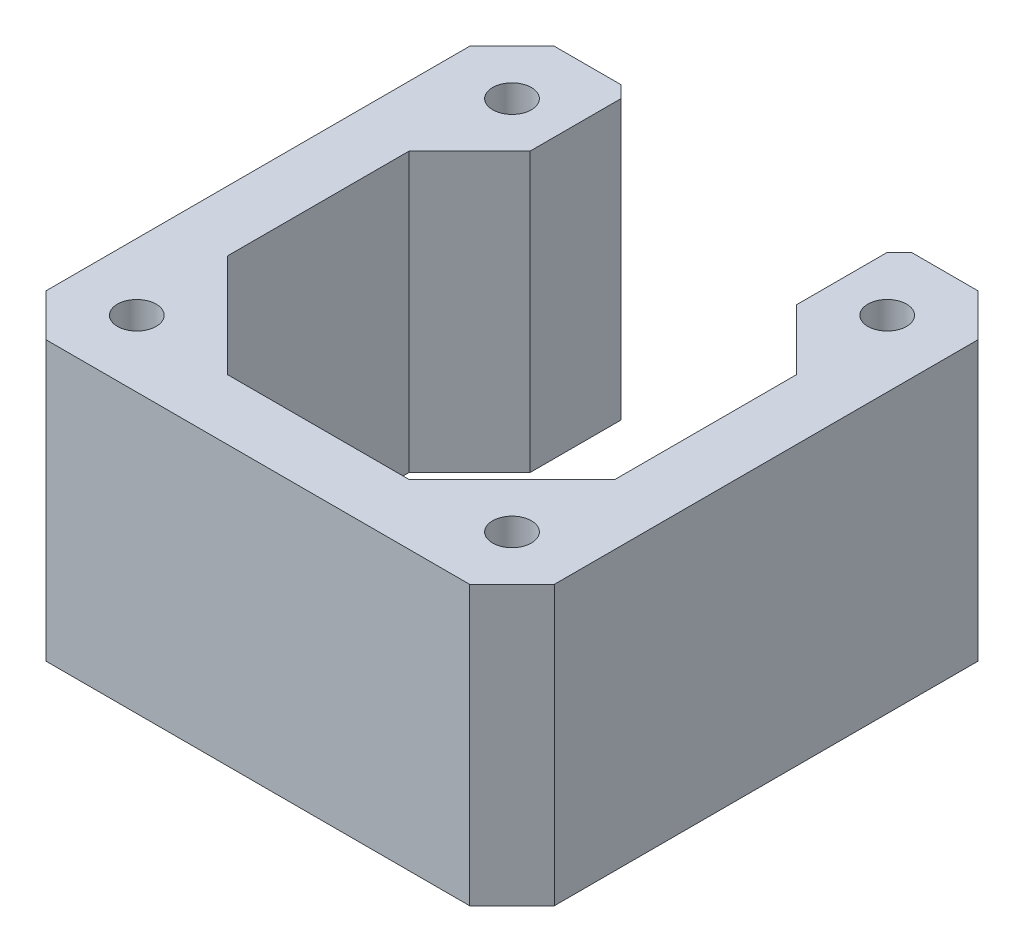
ISO-10303-21;
HEADER;
FILE_DESCRIPTION(('STEP AP214'),'2;1');
FILE_NAME('part.step','',(''),(''),'','','');
FILE_SCHEMA(('AUTOMOTIVE_DESIGN { 1 0 10303 214 1 1 1 1 }'));
ENDSEC;
DATA;
#1=APPLICATION_CONTEXT('core data for automotive mechanical design processes');
#2=APPLICATION_PROTOCOL_DEFINITION('international standard','automotive_design',2000,#1);
#3=PRODUCT_CONTEXT('',#1,'mechanical');
#4=PRODUCT('Part','Part','',(#3));
#5=PRODUCT_RELATED_PRODUCT_CATEGORY('part','',(#4));
#6=PRODUCT_DEFINITION_FORMATION('','',#4);
#7=PRODUCT_DEFINITION_CONTEXT('part definition',#1,'design');
#8=PRODUCT_DEFINITION('design','',#6,#7);
#9=PRODUCT_DEFINITION_SHAPE('','',#8);
#10=(LENGTH_UNIT() NAMED_UNIT(*) SI_UNIT(.MILLI.,.METRE.));
#11=(NAMED_UNIT(*) PLANE_ANGLE_UNIT() SI_UNIT($,.RADIAN.));
#12=(NAMED_UNIT(*) SI_UNIT($,.STERADIAN.) SOLID_ANGLE_UNIT());
#13=UNCERTAINTY_MEASURE_WITH_UNIT(LENGTH_MEASURE(1.E-05),#10,'distance_accuracy_value','');
#14=(GEOMETRIC_REPRESENTATION_CONTEXT(3) GLOBAL_UNCERTAINTY_ASSIGNED_CONTEXT((#13)) GLOBAL_UNIT_ASSIGNED_CONTEXT((#10,
#11,#12)) REPRESENTATION_CONTEXT('',''));
#15=CARTESIAN_POINT('',(0.,0.,0.));
#16=DIRECTION('',(0.,0.,1.));
#17=DIRECTION('',(1.,0.,0.));
#18=AXIS2_PLACEMENT_3D('',#15,#16,#17);
#19=CARTESIAN_POINT('',(-21.,-0.0001,17.49999999825));
#20=DIRECTION('',(-0.707106781186547,0.,0.707106781186548));
#21=DIRECTION('',(0.707106781186548,0.,0.707106781186547));
#22=AXIS2_PLACEMENT_3D('',#19,#20,#21);
#23=PLANE('',#22);
#24=DIRECTION('',(0.,1.,0.));
#25=VECTOR('',#24,1.);
#26=CARTESIAN_POINT('',(-17.5,-0.0001,20.99999999825));
#27=LINE('',#26,#25);
#28=CARTESIAN_POINT('',(-17.5,-0.0001,20.99999999825));
#29=VERTEX_POINT('',#28);
#30=CARTESIAN_POINT('',(-17.5,23.,20.99999999825));
#31=VERTEX_POINT('',#30);
#32=EDGE_CURVE('E40',#29,#31,#27,.T.);
#33=ORIENTED_EDGE('',*,*,#32,.T.);
#34=DIRECTION('',(0.707106781186548,0.,0.707106781186547));
#35=VECTOR('',#34,1.);
#36=CARTESIAN_POINT('',(-21.,23.,17.49999999825));
#37=LINE('',#36,#35);
#38=CARTESIAN_POINT('',(-21.,23.,17.49999999825));
#39=VERTEX_POINT('',#38);
#40=EDGE_CURVE('E173',#39,#31,#37,.T.);
#41=ORIENTED_EDGE('',*,*,#40,.F.);
#42=DIRECTION('',(0.,1.,0.));
#43=VECTOR('',#42,1.);
#44=CARTESIAN_POINT('',(-21.,-0.0001,17.49999999825));
#45=LINE('',#44,#43);
#46=CARTESIAN_POINT('',(-21.,-0.0001,17.49999999825));
#47=VERTEX_POINT('',#46);
#48=EDGE_CURVE('E11',#47,#39,#45,.T.);
#49=ORIENTED_EDGE('',*,*,#48,.F.);
#50=DIRECTION('',(0.707106781186548,0.,0.707106781186547));
#51=VECTOR('',#50,1.);
#52=CARTESIAN_POINT('',(-21.,-0.0001,17.49999999825));
#53=LINE('',#52,#51);
#54=EDGE_CURVE('E174',#47,#29,#53,.T.);
#55=ORIENTED_EDGE('',*,*,#54,.T.);
#56=EDGE_LOOP('',(#33,#41,#49,#55));
#57=FACE_BOUND('',#56,.T.);
#58=ADVANCED_FACE('F37',(#57),#23,.T.);
#59=CARTESIAN_POINT('',(-21.,-0.0001,-17.50000000875));
#60=DIRECTION('',(-1.,0.,0.));
#61=DIRECTION('',(0.,0.,1.));
#62=AXIS2_PLACEMENT_3D('',#59,#60,#61);
#63=PLANE('',#62);
#64=ORIENTED_EDGE('',*,*,#48,.T.);
#65=DIRECTION('',(0.,0.,1.));
#66=VECTOR('',#65,1.);
#67=CARTESIAN_POINT('',(-21.,23.,-17.50000000875));
#68=LINE('',#67,#66);
#69=CARTESIAN_POINT('',(-21.,23.,-17.50000000875));
#70=VERTEX_POINT('',#69);
#71=EDGE_CURVE('E192',#70,#39,#68,.T.);
#72=ORIENTED_EDGE('',*,*,#71,.F.);
#73=DIRECTION('',(0.,1.,0.));
#74=VECTOR('',#73,1.);
#75=CARTESIAN_POINT('',(-21.,-0.0001,-17.50000000875));
#76=LINE('',#75,#74);
#77=CARTESIAN_POINT('',(-21.,-0.0001,-17.50000000875));
#78=VERTEX_POINT('',#77);
#79=EDGE_CURVE('E45',#78,#70,#76,.T.);
#80=ORIENTED_EDGE('',*,*,#79,.F.);
#81=DIRECTION('',(0.,0.,1.));
#82=VECTOR('',#81,1.);
#83=CARTESIAN_POINT('',(-21.,-0.0001,-17.50000000875));
#84=LINE('',#83,#82);
#85=EDGE_CURVE('E179',#78,#47,#84,.T.);
#86=ORIENTED_EDGE('',*,*,#85,.T.);
#87=EDGE_LOOP('',(#64,#72,#80,#86));
#88=FACE_BOUND('',#87,.T.);
#89=ADVANCED_FACE('F417',(#88),#63,.T.);
#90=CARTESIAN_POINT('',(-17.5000000035,-0.0001,-21.00000000525));
#91=DIRECTION('',(-0.707106781186548,0.,-0.707106781186547));
#92=DIRECTION('',(-0.707106781186547,0.,0.707106781186548));
#93=AXIS2_PLACEMENT_3D('',#90,#91,#92);
#94=PLANE('',#93);
#95=ORIENTED_EDGE('',*,*,#79,.T.);
#96=DIRECTION('',(-0.707106781186547,0.,0.707106781186548));
#97=VECTOR('',#96,1.);
#98=CARTESIAN_POINT('',(-17.5000000035,23.,-21.00000000525));
#99=LINE('',#98,#97);
#100=CARTESIAN_POINT('',(-17.5000000035,23.,-21.00000000525));
#101=VERTEX_POINT('',#100);
#102=EDGE_CURVE('E246',#101,#70,#99,.T.);
#103=ORIENTED_EDGE('',*,*,#102,.F.);
#104=DIRECTION('',(0.,1.,0.));
#105=VECTOR('',#104,1.);
#106=CARTESIAN_POINT('',(-17.5000000035,-0.0001,-21.00000000525));
#107=LINE('',#106,#105);
#108=CARTESIAN_POINT('',(-17.5000000035,-0.0001,-21.00000000525));
#109=VERTEX_POINT('',#108);
#110=EDGE_CURVE('E316',#109,#101,#107,.T.);
#111=ORIENTED_EDGE('',*,*,#110,.F.);
#112=DIRECTION('',(-0.707106781186547,0.,0.707106781186548));
#113=VECTOR('',#112,1.);
#114=CARTESIAN_POINT('',(-17.5000000035,-0.0001,-21.00000000525));
#115=LINE('',#114,#113);
#116=EDGE_CURVE('E312',#109,#78,#115,.T.);
#117=ORIENTED_EDGE('',*,*,#116,.T.);
#118=EDGE_LOOP('',(#95,#103,#111,#117));
#119=FACE_BOUND('',#118,.T.);
#120=ADVANCED_FACE('F416',(#119),#94,.T.);
#121=CARTESIAN_POINT('',(-17.5000000035,-0.0001,-21.00000000525));
#122=DIRECTION('',(0.,0.,-1.));
#123=DIRECTION('',(-1.,0.,0.));
#124=AXIS2_PLACEMENT_3D('',#121,#122,#123);
#125=PLANE('',#124);
#126=ORIENTED_EDGE('',*,*,#110,.T.);
#127=DIRECTION('',(-1.,0.,0.));
#128=VECTOR('',#127,1.);
#129=CARTESIAN_POINT('',(-17.5000000035,23.,-21.00000000525));
#130=LINE('',#129,#128);
#131=CARTESIAN_POINT('',(-11.9999999995882,23.,-21.00000000525));
#132=VERTEX_POINT('',#131);
#133=EDGE_CURVE('E243',#132,#101,#130,.T.);
#134=ORIENTED_EDGE('',*,*,#133,.F.);
#135=DIRECTION('',(0.,1.,0.));
#136=VECTOR('',#135,1.);
#137=CARTESIAN_POINT('',(-11.9999999995882,-0.0001,-21.00000000525));
#138=LINE('',#137,#136);
#139=CARTESIAN_POINT('',(-11.9999999995882,-0.0001,-21.00000000525));
#140=VERTEX_POINT('',#139);
#141=EDGE_CURVE('E318',#140,#132,#138,.T.);
#142=ORIENTED_EDGE('',*,*,#141,.F.);
#143=DIRECTION('',(-1.,0.,0.));
#144=VECTOR('',#143,1.);
#145=CARTESIAN_POINT('',(-17.5000000035,-0.0001,-21.00000000525));
#146=LINE('',#145,#144);
#147=EDGE_CURVE('E309',#140,#109,#146,.T.);
#148=ORIENTED_EDGE('',*,*,#147,.T.);
#149=EDGE_LOOP('',(#126,#134,#142,#148));
#150=FACE_BOUND('',#149,.T.);
#151=ADVANCED_FACE('F412',(#150),#125,.T.);
#152=CARTESIAN_POINT('',(-11.9999999995882,-0.0001,-21.00000000525));
#153=DIRECTION('',(0.707106781186547,0.,-0.707106781186548));
#154=DIRECTION('',(-0.707106781186548,0.,-0.707106781186547));
#155=AXIS2_PLACEMENT_3D('',#152,#153,#154);
#156=PLANE('',#155);
#157=ORIENTED_EDGE('',*,*,#141,.T.);
#158=DIRECTION('',(-0.707106781186548,0.,-0.707106781186547));
#159=VECTOR('',#158,1.);
#160=CARTESIAN_POINT('',(-11.9999999995882,23.,-21.00000000525));
#161=LINE('',#160,#159);
#162=CARTESIAN_POINT('',(-10.9999999995882,23.,-20.00000000525));
#163=VERTEX_POINT('',#162);
#164=EDGE_CURVE('E240',#163,#132,#161,.T.);
#165=ORIENTED_EDGE('',*,*,#164,.F.);
#166=DIRECTION('',(0.,1.,0.));
#167=VECTOR('',#166,1.);
#168=CARTESIAN_POINT('',(-10.9999999995882,-0.0001,-20.00000000525));
#169=LINE('',#168,#167);
#170=CARTESIAN_POINT('',(-10.9999999995882,-0.0001,-20.00000000525));
#171=VERTEX_POINT('',#170);
#172=EDGE_CURVE('E320',#171,#163,#169,.T.);
#173=ORIENTED_EDGE('',*,*,#172,.F.);
#174=DIRECTION('',(-0.707106781186548,0.,-0.707106781186547));
#175=VECTOR('',#174,1.);
#176=CARTESIAN_POINT('',(-11.9999999995882,-0.0001,-21.00000000525));
#177=LINE('',#176,#175);
#178=EDGE_CURVE('E306',#171,#140,#177,.T.);
#179=ORIENTED_EDGE('',*,*,#178,.T.);
#180=EDGE_LOOP('',(#157,#165,#173,#179));
#181=FACE_BOUND('',#180,.T.);
#182=ADVANCED_FACE('F407',(#181),#156,.T.);
#183=CARTESIAN_POINT('',(-10.9999999995882,-0.0001,-20.00000000525));
#184=DIRECTION('',(1.,0.,0.));
#185=DIRECTION('',(0.,0.,-1.));
#186=AXIS2_PLACEMENT_3D('',#183,#184,#185);
#187=PLANE('',#186);
#188=ORIENTED_EDGE('',*,*,#172,.T.);
#189=DIRECTION('',(0.,0.,-1.));
#190=VECTOR('',#189,1.);
#191=CARTESIAN_POINT('',(-10.9999999995882,23.,-20.00000000525));
#192=LINE('',#191,#190);
#193=CARTESIAN_POINT('',(-10.9999999995882,23.,-12.5000000021618));
#194=VERTEX_POINT('',#193);
#195=EDGE_CURVE('E237',#194,#163,#192,.T.);
#196=ORIENTED_EDGE('',*,*,#195,.F.);
#197=DIRECTION('',(0.,1.,0.));
#198=VECTOR('',#197,1.);
#199=CARTESIAN_POINT('',(-10.9999999995882,-0.0001,-12.5000000021618));
#200=LINE('',#199,#198);
#201=CARTESIAN_POINT('',(-10.9999999995882,-0.0001,-12.5000000021618));
#202=VERTEX_POINT('',#201);
#203=EDGE_CURVE('E322',#202,#194,#200,.T.);
#204=ORIENTED_EDGE('',*,*,#203,.F.);
#205=DIRECTION('',(0.,0.,-1.));
#206=VECTOR('',#205,1.);
#207=CARTESIAN_POINT('',(-10.9999999995882,-0.0001,-20.00000000525));
#208=LINE('',#207,#206);
#209=EDGE_CURVE('E303',#202,#171,#208,.T.);
#210=ORIENTED_EDGE('',*,*,#209,.T.);
#211=EDGE_LOOP('',(#188,#196,#204,#210));
#212=FACE_BOUND('',#211,.T.);
#213=ADVANCED_FACE('F405',(#212),#187,.T.);
#214=CARTESIAN_POINT('',(-10.9999999995882,-0.0001,-12.5000000021618));
#215=DIRECTION('',(0.707106781186547,0.,0.707106781186548));
#216=DIRECTION('',(0.707106781186548,0.,-0.707106781186547));
#217=AXIS2_PLACEMENT_3D('',#214,#215,#216);
#218=PLANE('',#217);
#219=ORIENTED_EDGE('',*,*,#203,.T.);
#220=DIRECTION('',(0.707106781186548,0.,-0.707106781186547));
#221=VECTOR('',#220,1.);
#222=CARTESIAN_POINT('',(-10.9999999995882,23.,-12.5000000021618));
#223=LINE('',#222,#221);
#224=CARTESIAN_POINT('',(-16.,23.,-7.50000000175));
#225=VERTEX_POINT('',#224);
#226=EDGE_CURVE('E234',#225,#194,#223,.T.);
#227=ORIENTED_EDGE('',*,*,#226,.F.);
#228=DIRECTION('',(0.,1.,0.));
#229=VECTOR('',#228,1.);
#230=CARTESIAN_POINT('',(-16.,-0.0001,-7.50000000175));
#231=LINE('',#230,#229);
#232=CARTESIAN_POINT('',(-16.,-0.0001,-7.50000000175));
#233=VERTEX_POINT('',#232);
#234=EDGE_CURVE('E324',#233,#225,#231,.T.);
#235=ORIENTED_EDGE('',*,*,#234,.F.);
#236=DIRECTION('',(0.707106781186548,0.,-0.707106781186547));
#237=VECTOR('',#236,1.);
#238=CARTESIAN_POINT('',(-10.9999999995882,-0.0001,-12.5000000021618));
#239=LINE('',#238,#237);
#240=EDGE_CURVE('E300',#233,#202,#239,.T.);
#241=ORIENTED_EDGE('',*,*,#240,.T.);
#242=EDGE_LOOP('',(#219,#227,#235,#241));
#243=FACE_BOUND('',#242,.T.);
#244=ADVANCED_FACE('F400',(#243),#218,.T.);
#245=CARTESIAN_POINT('',(-16.,-0.0001,-7.50000000175));
#246=DIRECTION('',(1.,0.,0.));
#247=DIRECTION('',(0.,0.,-1.));
#248=AXIS2_PLACEMENT_3D('',#245,#246,#247);
#249=PLANE('',#248);
#250=ORIENTED_EDGE('',*,*,#234,.T.);
#251=DIRECTION('',(0.,0.,-1.));
#252=VECTOR('',#251,1.);
#253=CARTESIAN_POINT('',(-16.,23.,-7.50000000175));
#254=LINE('',#253,#252);
#255=CARTESIAN_POINT('',(-16.,23.,7.49999999825));
#256=VERTEX_POINT('',#255);
#257=EDGE_CURVE('E231',#256,#225,#254,.T.);
#258=ORIENTED_EDGE('',*,*,#257,.F.);
#259=DIRECTION('',(0.,1.,0.));
#260=VECTOR('',#259,1.);
#261=CARTESIAN_POINT('',(-16.,-0.0001,7.49999999825));
#262=LINE('',#261,#260);
#263=CARTESIAN_POINT('',(-16.,-0.0001,7.49999999825));
#264=VERTEX_POINT('',#263);
#265=EDGE_CURVE('E326',#264,#256,#262,.T.);
#266=ORIENTED_EDGE('',*,*,#265,.F.);
#267=DIRECTION('',(0.,0.,-1.));
#268=VECTOR('',#267,1.);
#269=CARTESIAN_POINT('',(-16.,-0.0001,-7.50000000175));
#270=LINE('',#269,#268);
#271=EDGE_CURVE('E297',#264,#233,#270,.T.);
#272=ORIENTED_EDGE('',*,*,#271,.T.);
#273=EDGE_LOOP('',(#250,#258,#266,#272));
#274=FACE_BOUND('',#273,.T.);
#275=ADVANCED_FACE('F395',(#274),#249,.T.);
#276=CARTESIAN_POINT('',(-16.,-0.0001,7.49999999825));
#277=DIRECTION('',(0.707106781186547,0.,-0.707106781186548));
#278=DIRECTION('',(-0.707106781186548,0.,-0.707106781186547));
#279=AXIS2_PLACEMENT_3D('',#276,#277,#278);
#280=PLANE('',#279);
#281=ORIENTED_EDGE('',*,*,#265,.T.);
#282=DIRECTION('',(-0.707106781186548,0.,-0.707106781186547));
#283=VECTOR('',#282,1.);
#284=CARTESIAN_POINT('',(-16.,23.,7.49999999825));
#285=LINE('',#284,#283);
#286=CARTESIAN_POINT('',(-7.5,23.,15.99999999825));
#287=VERTEX_POINT('',#286);
#288=EDGE_CURVE('E228',#287,#256,#285,.T.);
#289=ORIENTED_EDGE('',*,*,#288,.F.);
#290=DIRECTION('',(0.,1.,0.));
#291=VECTOR('',#290,1.);
#292=CARTESIAN_POINT('',(-7.5,-0.0001,15.99999999825));
#293=LINE('',#292,#291);
#294=CARTESIAN_POINT('',(-7.5,-0.0001,15.99999999825));
#295=VERTEX_POINT('',#294);
#296=EDGE_CURVE('E328',#295,#287,#293,.T.);
#297=ORIENTED_EDGE('',*,*,#296,.F.);
#298=DIRECTION('',(-0.707106781186548,0.,-0.707106781186547));
#299=VECTOR('',#298,1.);
#300=CARTESIAN_POINT('',(-16.,-0.0001,7.49999999825));
#301=LINE('',#300,#299);
#302=EDGE_CURVE('E294',#295,#264,#301,.T.);
#303=ORIENTED_EDGE('',*,*,#302,.T.);
#304=EDGE_LOOP('',(#281,#289,#297,#303));
#305=FACE_BOUND('',#304,.T.);
#306=ADVANCED_FACE('F393',(#305),#280,.T.);
#307=CARTESIAN_POINT('',(-7.5,-0.0001,15.99999999825));
#308=DIRECTION('',(0.,0.,-1.));
#309=DIRECTION('',(-1.,0.,0.));
#310=AXIS2_PLACEMENT_3D('',#307,#308,#309);
#311=PLANE('',#310);
#312=ORIENTED_EDGE('',*,*,#296,.T.);
#313=DIRECTION('',(-1.,0.,0.));
#314=VECTOR('',#313,1.);
#315=CARTESIAN_POINT('',(-7.5,23.,15.99999999825));
#316=LINE('',#315,#314);
#317=CARTESIAN_POINT('',(7.5,23.,15.99999999825));
#318=VERTEX_POINT('',#317);
#319=EDGE_CURVE('E225',#318,#287,#316,.T.);
#320=ORIENTED_EDGE('',*,*,#319,.F.);
#321=DIRECTION('',(0.,1.,0.));
#322=VECTOR('',#321,1.);
#323=CARTESIAN_POINT('',(7.5,-0.0001,15.99999999825));
#324=LINE('',#323,#322);
#325=CARTESIAN_POINT('',(7.5,-0.0001,15.99999999825));
#326=VERTEX_POINT('',#325);
#327=EDGE_CURVE('E330',#326,#318,#324,.T.);
#328=ORIENTED_EDGE('',*,*,#327,.F.);
#329=DIRECTION('',(-1.,0.,0.));
#330=VECTOR('',#329,1.);
#331=CARTESIAN_POINT('',(-7.5,-0.0001,15.99999999825));
#332=LINE('',#331,#330);
#333=EDGE_CURVE('E291',#326,#295,#332,.T.);
#334=ORIENTED_EDGE('',*,*,#333,.T.);
#335=EDGE_LOOP('',(#312,#320,#328,#334));
#336=FACE_BOUND('',#335,.T.);
#337=ADVANCED_FACE('F388',(#336),#311,.T.);
#338=CARTESIAN_POINT('',(16.,-0.0001,7.49999999825));
#339=DIRECTION('',(-0.707106781186547,0.,-0.707106781186548));
#340=DIRECTION('',(-0.707106781186548,0.,0.707106781186547));
#341=AXIS2_PLACEMENT_3D('',#338,#339,#340);
#342=PLANE('',#341);
#343=ORIENTED_EDGE('',*,*,#327,.T.);
#344=DIRECTION('',(-0.707106781186548,0.,0.707106781186547));
#345=VECTOR('',#344,1.);
#346=CARTESIAN_POINT('',(16.,23.,7.49999999825));
#347=LINE('',#346,#345);
#348=CARTESIAN_POINT('',(16.,23.,7.49999999825));
#349=VERTEX_POINT('',#348);
#350=EDGE_CURVE('E222',#349,#318,#347,.T.);
#351=ORIENTED_EDGE('',*,*,#350,.F.);
#352=DIRECTION('',(0.,1.,0.));
#353=VECTOR('',#352,1.);
#354=CARTESIAN_POINT('',(16.,-0.0001,7.49999999825));
#355=LINE('',#354,#353);
#356=CARTESIAN_POINT('',(16.,-0.0001,7.49999999825));
#357=VERTEX_POINT('',#356);
#358=EDGE_CURVE('E332',#357,#349,#355,.T.);
#359=ORIENTED_EDGE('',*,*,#358,.F.);
#360=DIRECTION('',(-0.707106781186548,0.,0.707106781186547));
#361=VECTOR('',#360,1.);
#362=CARTESIAN_POINT('',(16.,-0.0001,7.49999999825));
#363=LINE('',#362,#361);
#364=EDGE_CURVE('E288',#357,#326,#363,.T.);
#365=ORIENTED_EDGE('',*,*,#364,.T.);
#366=EDGE_LOOP('',(#343,#351,#359,#365));
#367=FACE_BOUND('',#366,.T.);
#368=ADVANCED_FACE('F383',(#367),#342,.T.);
#369=CARTESIAN_POINT('',(16.,-0.0001,-7.50000000175));
#370=DIRECTION('',(-1.,0.,0.));
#371=DIRECTION('',(0.,0.,1.));
#372=AXIS2_PLACEMENT_3D('',#369,#370,#371);
#373=PLANE('',#372);
#374=ORIENTED_EDGE('',*,*,#358,.T.);
#375=DIRECTION('',(0.,0.,1.));
#376=VECTOR('',#375,1.);
#377=CARTESIAN_POINT('',(16.,23.,-7.50000000175));
#378=LINE('',#377,#376);
#379=CARTESIAN_POINT('',(16.,23.,-7.50000000175));
#380=VERTEX_POINT('',#379);
#381=EDGE_CURVE('E219',#380,#349,#378,.T.);
#382=ORIENTED_EDGE('',*,*,#381,.F.);
#383=DIRECTION('',(0.,1.,0.));
#384=VECTOR('',#383,1.);
#385=CARTESIAN_POINT('',(16.,-0.0001,-7.50000000175));
#386=LINE('',#385,#384);
#387=CARTESIAN_POINT('',(16.,-0.0001,-7.50000000175));
#388=VERTEX_POINT('',#387);
#389=EDGE_CURVE('E334',#388,#380,#386,.T.);
#390=ORIENTED_EDGE('',*,*,#389,.F.);
#391=DIRECTION('',(0.,0.,1.));
#392=VECTOR('',#391,1.);
#393=CARTESIAN_POINT('',(16.,-0.0001,-7.50000000175));
#394=LINE('',#393,#392);
#395=EDGE_CURVE('E285',#388,#357,#394,.T.);
#396=ORIENTED_EDGE('',*,*,#395,.T.);
#397=EDGE_LOOP('',(#374,#382,#390,#396));
#398=FACE_BOUND('',#397,.T.);
#399=ADVANCED_FACE('F381',(#398),#373,.T.);
#400=CARTESIAN_POINT('',(10.9999999995882,-0.0001,-12.5000000021618));
#401=DIRECTION('',(-0.707106781186547,0.,0.707106781186548));
#402=DIRECTION('',(0.707106781186548,0.,0.707106781186547));
#403=AXIS2_PLACEMENT_3D('',#400,#401,#402);
#404=PLANE('',#403);
#405=ORIENTED_EDGE('',*,*,#389,.T.);
#406=DIRECTION('',(0.707106781186548,0.,0.707106781186547));
#407=VECTOR('',#406,1.);
#408=CARTESIAN_POINT('',(10.9999999995882,23.,-12.5000000021618));
#409=LINE('',#408,#407);
#410=CARTESIAN_POINT('',(10.9999999995882,23.,-12.5000000021618));
#411=VERTEX_POINT('',#410);
#412=EDGE_CURVE('E216',#411,#380,#409,.T.);
#413=ORIENTED_EDGE('',*,*,#412,.F.);
#414=DIRECTION('',(0.,1.,0.));
#415=VECTOR('',#414,1.);
#416=CARTESIAN_POINT('',(10.9999999995882,-0.0001,-12.5000000021618));
#417=LINE('',#416,#415);
#418=CARTESIAN_POINT('',(10.9999999995882,-0.0001,-12.5000000021618));
#419=VERTEX_POINT('',#418);
#420=EDGE_CURVE('E336',#419,#411,#417,.T.);
#421=ORIENTED_EDGE('',*,*,#420,.F.);
#422=DIRECTION('',(0.707106781186548,0.,0.707106781186547));
#423=VECTOR('',#422,1.);
#424=CARTESIAN_POINT('',(10.9999999995882,-0.0001,-12.5000000021618));
#425=LINE('',#424,#423);
#426=EDGE_CURVE('E282',#419,#388,#425,.T.);
#427=ORIENTED_EDGE('',*,*,#426,.T.);
#428=EDGE_LOOP('',(#405,#413,#421,#427));
#429=FACE_BOUND('',#428,.T.);
#430=ADVANCED_FACE('F376',(#429),#404,.T.);
#431=CARTESIAN_POINT('',(10.9999999995882,-0.0001,-20.00000000525));
#432=DIRECTION('',(-1.,0.,0.));
#433=DIRECTION('',(0.,0.,1.));
#434=AXIS2_PLACEMENT_3D('',#431,#432,#433);
#435=PLANE('',#434);
#436=ORIENTED_EDGE('',*,*,#420,.T.);
#437=DIRECTION('',(0.,0.,1.));
#438=VECTOR('',#437,1.);
#439=CARTESIAN_POINT('',(10.9999999995882,23.,-20.00000000525));
#440=LINE('',#439,#438);
#441=CARTESIAN_POINT('',(10.9999999995882,23.,-20.00000000525));
#442=VERTEX_POINT('',#441);
#443=EDGE_CURVE('E213',#442,#411,#440,.T.);
#444=ORIENTED_EDGE('',*,*,#443,.F.);
#445=DIRECTION('',(0.,1.,0.));
#446=VECTOR('',#445,1.);
#447=CARTESIAN_POINT('',(10.9999999995882,-0.0001,-20.00000000525));
#448=LINE('',#447,#446);
#449=CARTESIAN_POINT('',(10.9999999995882,-0.0001,-20.00000000525));
#450=VERTEX_POINT('',#449);
#451=EDGE_CURVE('E338',#450,#442,#448,.T.);
#452=ORIENTED_EDGE('',*,*,#451,.F.);
#453=DIRECTION('',(0.,0.,1.));
#454=VECTOR('',#453,1.);
#455=CARTESIAN_POINT('',(10.9999999995882,-0.0001,-20.00000000525));
#456=LINE('',#455,#454);
#457=EDGE_CURVE('E279',#450,#419,#456,.T.);
#458=ORIENTED_EDGE('',*,*,#457,.T.);
#459=EDGE_LOOP('',(#436,#444,#452,#458));
#460=FACE_BOUND('',#459,.T.);
#461=ADVANCED_FACE('F371',(#460),#435,.T.);
#462=CARTESIAN_POINT('',(11.9999999995882,-0.0001,-21.00000000525));
#463=DIRECTION('',(-0.707106781186549,0.,-0.707106781186546));
#464=DIRECTION('',(-0.707106781186546,0.,0.707106781186549));
#465=AXIS2_PLACEMENT_3D('',#462,#463,#464);
#466=PLANE('',#465);
#467=ORIENTED_EDGE('',*,*,#451,.T.);
#468=DIRECTION('',(-0.707106781186546,0.,0.707106781186549));
#469=VECTOR('',#468,1.);
#470=CARTESIAN_POINT('',(11.9999999995882,23.,-21.00000000525));
#471=LINE('',#470,#469);
#472=CARTESIAN_POINT('',(11.9999999995882,23.,-21.00000000525));
#473=VERTEX_POINT('',#472);
#474=EDGE_CURVE('E210',#473,#442,#471,.T.);
#475=ORIENTED_EDGE('',*,*,#474,.F.);
#476=DIRECTION('',(0.,1.,0.));
#477=VECTOR('',#476,1.);
#478=CARTESIAN_POINT('',(11.9999999995882,-0.0001,-21.00000000525));
#479=LINE('',#478,#477);
#480=CARTESIAN_POINT('',(11.9999999995882,-0.0001,-21.00000000525));
#481=VERTEX_POINT('',#480);
#482=EDGE_CURVE('E340',#481,#473,#479,.T.);
#483=ORIENTED_EDGE('',*,*,#482,.F.);
#484=DIRECTION('',(-0.707106781186546,0.,0.707106781186549));
#485=VECTOR('',#484,1.);
#486=CARTESIAN_POINT('',(11.9999999995882,-0.0001,-21.00000000525));
#487=LINE('',#486,#485);
#488=EDGE_CURVE('E276',#481,#450,#487,.T.);
#489=ORIENTED_EDGE('',*,*,#488,.T.);
#490=EDGE_LOOP('',(#467,#475,#483,#489));
#491=FACE_BOUND('',#490,.T.);
#492=ADVANCED_FACE('F369',(#491),#466,.T.);
#493=CARTESIAN_POINT('',(17.5000000035,-0.0001,-21.00000000525));
#494=DIRECTION('',(0.,0.,-1.));
#495=DIRECTION('',(-1.,0.,0.));
#496=AXIS2_PLACEMENT_3D('',#493,#494,#495);
#497=PLANE('',#496);
#498=ORIENTED_EDGE('',*,*,#482,.T.);
#499=DIRECTION('',(-1.,0.,0.));
#500=VECTOR('',#499,1.);
#501=CARTESIAN_POINT('',(17.5000000035,23.,-21.00000000525));
#502=LINE('',#501,#500);
#503=CARTESIAN_POINT('',(17.5000000035,23.,-21.00000000525));
#504=VERTEX_POINT('',#503);
#505=EDGE_CURVE('E207',#504,#473,#502,.T.);
#506=ORIENTED_EDGE('',*,*,#505,.F.);
#507=DIRECTION('',(0.,1.,0.));
#508=VECTOR('',#507,1.);
#509=CARTESIAN_POINT('',(17.5000000035,-0.0001,-21.00000000525));
#510=LINE('',#509,#508);
#511=CARTESIAN_POINT('',(17.5000000035,-0.0001,-21.00000000525));
#512=VERTEX_POINT('',#511);
#513=EDGE_CURVE('E342',#512,#504,#510,.T.);
#514=ORIENTED_EDGE('',*,*,#513,.F.);
#515=DIRECTION('',(-1.,0.,0.));
#516=VECTOR('',#515,1.);
#517=CARTESIAN_POINT('',(17.5000000035,-0.0001,-21.00000000525));
#518=LINE('',#517,#516);
#519=EDGE_CURVE('E273',#512,#481,#518,.T.);
#520=ORIENTED_EDGE('',*,*,#519,.T.);
#521=EDGE_LOOP('',(#498,#506,#514,#520));
#522=FACE_BOUND('',#521,.T.);
#523=ADVANCED_FACE('F364',(#522),#497,.T.);
#524=CARTESIAN_POINT('',(17.5000000035,-0.0001,-21.00000000525));
#525=DIRECTION('',(0.707106781186548,0.,-0.707106781186547));
#526=DIRECTION('',(-0.707106781186547,0.,-0.707106781186548));
#527=AXIS2_PLACEMENT_3D('',#524,#525,#526);
#528=PLANE('',#527);
#529=ORIENTED_EDGE('',*,*,#513,.T.);
#530=DIRECTION('',(-0.707106781186547,0.,-0.707106781186548));
#531=VECTOR('',#530,1.);
#532=CARTESIAN_POINT('',(17.5000000035,23.,-21.00000000525));
#533=LINE('',#532,#531);
#534=CARTESIAN_POINT('',(21.,23.,-17.50000000875));
#535=VERTEX_POINT('',#534);
#536=EDGE_CURVE('E204',#535,#504,#533,.T.);
#537=ORIENTED_EDGE('',*,*,#536,.F.);
#538=DIRECTION('',(0.,1.,0.));
#539=VECTOR('',#538,1.);
#540=CARTESIAN_POINT('',(21.,-0.0001,-17.50000000875));
#541=LINE('',#540,#539);
#542=CARTESIAN_POINT('',(21.,-0.0001,-17.50000000875));
#543=VERTEX_POINT('',#542);
#544=EDGE_CURVE('E344',#543,#535,#541,.T.);
#545=ORIENTED_EDGE('',*,*,#544,.F.);
#546=DIRECTION('',(-0.707106781186547,0.,-0.707106781186548));
#547=VECTOR('',#546,1.);
#548=CARTESIAN_POINT('',(17.5000000035,-0.0001,-21.00000000525));
#549=LINE('',#548,#547);
#550=EDGE_CURVE('E270',#543,#512,#549,.T.);
#551=ORIENTED_EDGE('',*,*,#550,.T.);
#552=EDGE_LOOP('',(#529,#537,#545,#551));
#553=FACE_BOUND('',#552,.T.);
#554=ADVANCED_FACE('F357',(#553),#528,.T.);
#555=CARTESIAN_POINT('',(21.,-0.0001,-17.50000000875));
#556=DIRECTION('',(1.,0.,0.));
#557=DIRECTION('',(0.,0.,-1.));
#558=AXIS2_PLACEMENT_3D('',#555,#556,#557);
#559=PLANE('',#558);
#560=ORIENTED_EDGE('',*,*,#544,.T.);
#561=DIRECTION('',(0.,0.,-1.));
#562=VECTOR('',#561,1.);
#563=CARTESIAN_POINT('',(21.,23.,-17.50000000875));
#564=LINE('',#563,#562);
#565=CARTESIAN_POINT('',(21.,23.,17.49999999825));
#566=VERTEX_POINT('',#565);
#567=EDGE_CURVE('E201',#566,#535,#564,.T.);
#568=ORIENTED_EDGE('',*,*,#567,.F.);
#569=DIRECTION('',(0.,1.,0.));
#570=VECTOR('',#569,1.);
#571=CARTESIAN_POINT('',(21.,-0.0001,17.49999999825));
#572=LINE('',#571,#570);
#573=CARTESIAN_POINT('',(21.,-0.0001,17.49999999825));
#574=VERTEX_POINT('',#573);
#575=EDGE_CURVE('E346',#574,#566,#572,.T.);
#576=ORIENTED_EDGE('',*,*,#575,.F.);
#577=DIRECTION('',(0.,0.,-1.));
#578=VECTOR('',#577,1.);
#579=CARTESIAN_POINT('',(21.,-0.0001,-17.50000000875));
#580=LINE('',#579,#578);
#581=EDGE_CURVE('E267',#574,#543,#580,.T.);
#582=ORIENTED_EDGE('',*,*,#581,.T.);
#583=EDGE_LOOP('',(#560,#568,#576,#582));
#584=FACE_BOUND('',#583,.T.);
#585=ADVANCED_FACE('F354',(#584),#559,.T.);
#586=CARTESIAN_POINT('',(21.,-0.0001,17.49999999825));
#587=DIRECTION('',(0.707106781186547,0.,0.707106781186548));
#588=DIRECTION('',(0.707106781186548,0.,-0.707106781186547));
#589=AXIS2_PLACEMENT_3D('',#586,#587,#588);
#590=PLANE('',#589);
#591=ORIENTED_EDGE('',*,*,#575,.T.);
#592=DIRECTION('',(0.707106781186548,0.,-0.707106781186547));
#593=VECTOR('',#592,1.);
#594=CARTESIAN_POINT('',(21.,23.,17.49999999825));
#595=LINE('',#594,#593);
#596=CARTESIAN_POINT('',(17.5,23.,20.99999999825));
#597=VERTEX_POINT('',#596);
#598=EDGE_CURVE('E186',#597,#566,#595,.T.);
#599=ORIENTED_EDGE('',*,*,#598,.F.);
#600=DIRECTION('',(0.,1.,0.));
#601=VECTOR('',#600,1.);
#602=CARTESIAN_POINT('',(17.5,-0.0001,20.99999999825));
#603=LINE('',#602,#601);
#604=CARTESIAN_POINT('',(17.5,-0.0001,20.99999999825));
#605=VERTEX_POINT('',#604);
#606=EDGE_CURVE('E178',#605,#597,#603,.T.);
#607=ORIENTED_EDGE('',*,*,#606,.F.);
#608=DIRECTION('',(0.707106781186548,0.,-0.707106781186547));
#609=VECTOR('',#608,1.);
#610=CARTESIAN_POINT('',(21.,-0.0001,17.49999999825));
#611=LINE('',#610,#609);
#612=EDGE_CURVE('E264',#605,#574,#611,.T.);
#613=ORIENTED_EDGE('',*,*,#612,.T.);
#614=EDGE_LOOP('',(#591,#599,#607,#613));
#615=FACE_BOUND('',#614,.T.);
#616=ADVANCED_FACE('F348',(#615),#590,.T.);
#617=CARTESIAN_POINT('',(-17.5,-0.0001,20.99999999825));
#618=DIRECTION('',(0.,0.,1.));
#619=DIRECTION('',(1.,0.,0.));
#620=AXIS2_PLACEMENT_3D('',#617,#618,#619);
#621=PLANE('',#620);
#622=ORIENTED_EDGE('',*,*,#606,.T.);
#623=DIRECTION('',(1.,0.,0.));
#624=VECTOR('',#623,1.);
#625=CARTESIAN_POINT('',(-17.5,23.,20.99999999825));
#626=LINE('',#625,#624);
#627=EDGE_CURVE('E181',#31,#597,#626,.T.);
#628=ORIENTED_EDGE('',*,*,#627,.F.);
#629=ORIENTED_EDGE('',*,*,#32,.F.);
#630=DIRECTION('',(1.,0.,0.));
#631=VECTOR('',#630,1.);
#632=CARTESIAN_POINT('',(-17.5,-0.0001,20.99999999825));
#633=LINE('',#632,#631);
#634=EDGE_CURVE('E262',#29,#605,#633,.T.);
#635=ORIENTED_EDGE('',*,*,#634,.T.);
#636=EDGE_LOOP('',(#622,#628,#629,#635));
#637=FACE_BOUND('',#636,.T.);
#638=ADVANCED_FACE('F182',(#637),#621,.T.);
#639=CARTESIAN_POINT('',(0.,-0.0001,0.));
#640=DIRECTION('',(0.,-1.,0.));
#641=DIRECTION('',(0.,0.,-1.));
#642=AXIS2_PLACEMENT_3D('',#639,#640,#641);
#643=PLANE('',#642);
#644=CARTESIAN_POINT('',(15.50000000175,-0.0001,-15.5));
#645=DIRECTION('',(0.,1.,0.));
#646=DIRECTION('',(0.,0.,-1.));
#647=AXIS2_PLACEMENT_3D('',#644,#645,#646);
#648=CIRCLE('',#647,1.6);
#649=CARTESIAN_POINT('',(15.50000000175,-0.0001,-17.1));
#650=VERTEX_POINT('',#649);
#651=EDGE_CURVE('E249',#650,#650,#648,.T.);
#652=ORIENTED_EDGE('',*,*,#651,.T.);
#653=EDGE_LOOP('',(#652));
#654=FACE_BOUND('',#653,.T.);
#655=CARTESIAN_POINT('',(15.50000000175,-0.0001,15.5));
#656=DIRECTION('',(0.,1.,0.));
#657=DIRECTION('',(0.,0.,-1.));
#658=AXIS2_PLACEMENT_3D('',#655,#656,#657);
#659=CIRCLE('',#658,1.6);
#660=CARTESIAN_POINT('',(15.50000000175,-0.0001,13.9));
#661=VERTEX_POINT('',#660);
#662=EDGE_CURVE('E252',#661,#661,#659,.T.);
#663=ORIENTED_EDGE('',*,*,#662,.T.);
#664=EDGE_LOOP('',(#663));
#665=FACE_BOUND('',#664,.T.);
#666=CARTESIAN_POINT('',(-15.50000000175,-0.0001,15.5));
#667=DIRECTION('',(0.,1.,0.));
#668=DIRECTION('',(0.,0.,1.));
#669=AXIS2_PLACEMENT_3D('',#666,#667,#668);
#670=CIRCLE('',#669,1.6);
#671=CARTESIAN_POINT('',(-15.50000000175,-0.0001,17.1));
#672=VERTEX_POINT('',#671);
#673=EDGE_CURVE('E255',#672,#672,#670,.T.);
#674=ORIENTED_EDGE('',*,*,#673,.T.);
#675=EDGE_LOOP('',(#674));
#676=FACE_BOUND('',#675,.T.);
#677=CARTESIAN_POINT('',(-15.50000000175,-0.0001,-15.5));
#678=DIRECTION('',(0.,1.,0.));
#679=DIRECTION('',(0.,0.,1.));
#680=AXIS2_PLACEMENT_3D('',#677,#678,#679);
#681=CIRCLE('',#680,1.6);
#682=CARTESIAN_POINT('',(-15.50000000175,-0.0001,-13.9));
#683=VERTEX_POINT('',#682);
#684=EDGE_CURVE('E258',#683,#683,#681,.T.);
#685=ORIENTED_EDGE('',*,*,#684,.T.);
#686=EDGE_LOOP('',(#685));
#687=FACE_BOUND('',#686,.T.);
#688=ORIENTED_EDGE('',*,*,#54,.F.);
#689=ORIENTED_EDGE('',*,*,#85,.F.);
#690=ORIENTED_EDGE('',*,*,#116,.F.);
#691=ORIENTED_EDGE('',*,*,#147,.F.);
#692=ORIENTED_EDGE('',*,*,#178,.F.);
#693=ORIENTED_EDGE('',*,*,#209,.F.);
#694=ORIENTED_EDGE('',*,*,#240,.F.);
#695=ORIENTED_EDGE('',*,*,#271,.F.);
#696=ORIENTED_EDGE('',*,*,#302,.F.);
#697=ORIENTED_EDGE('',*,*,#333,.F.);
#698=ORIENTED_EDGE('',*,*,#364,.F.);
#699=ORIENTED_EDGE('',*,*,#395,.F.);
#700=ORIENTED_EDGE('',*,*,#426,.F.);
#701=ORIENTED_EDGE('',*,*,#457,.F.);
#702=ORIENTED_EDGE('',*,*,#488,.F.);
#703=ORIENTED_EDGE('',*,*,#519,.F.);
#704=ORIENTED_EDGE('',*,*,#550,.F.);
#705=ORIENTED_EDGE('',*,*,#581,.F.);
#706=ORIENTED_EDGE('',*,*,#612,.F.);
#707=ORIENTED_EDGE('',*,*,#634,.F.);
#708=EDGE_LOOP('',(#688,#689,#690,#691,#692,#693,#694,#695,#696,#697,#698,#699,#700,#701,#702,
#703,#704,#705,#706,#707));
#709=FACE_BOUND('',#708,.T.);
#710=ADVANCED_FACE('F360',(#654,#665,#676,#687,#709),#643,.T.);
#711=CARTESIAN_POINT('',(-15.50000000175,-0.0001,-15.5));
#712=DIRECTION('',(0.,1.,0.));
#713=DIRECTION('',(0.,0.,1.));
#714=AXIS2_PLACEMENT_3D('',#711,#712,#713);
#715=CYLINDRICAL_SURFACE('',#714,1.6);
#716=ORIENTED_EDGE('',*,*,#684,.F.);
#717=EDGE_LOOP('',(#716));
#718=FACE_BOUND('',#717,.T.);
#719=CARTESIAN_POINT('',(-15.50000000175,23.,-15.5));
#720=DIRECTION('',(0.,1.,0.));
#721=DIRECTION('',(0.,0.,1.));
#722=AXIS2_PLACEMENT_3D('',#719,#720,#721);
#723=CIRCLE('',#722,1.6);
#724=CARTESIAN_POINT('',(-15.50000000175,23.,-13.9));
#725=VERTEX_POINT('',#724);
#726=EDGE_CURVE('E193',#725,#725,#723,.T.);
#727=ORIENTED_EDGE('',*,*,#726,.T.);
#728=EDGE_LOOP('',(#727));
#729=FACE_BOUND('',#728,.T.);
#730=ADVANCED_FACE('F463',(#718,#729),#715,.F.);
#731=CARTESIAN_POINT('',(-15.50000000175,-0.0001,15.5));
#732=DIRECTION('',(0.,1.,0.));
#733=DIRECTION('',(0.,0.,1.));
#734=AXIS2_PLACEMENT_3D('',#731,#732,#733);
#735=CYLINDRICAL_SURFACE('',#734,1.6);
#736=ORIENTED_EDGE('',*,*,#673,.F.);
#737=EDGE_LOOP('',(#736));
#738=FACE_BOUND('',#737,.T.);
#739=CARTESIAN_POINT('',(-15.50000000175,23.,15.5));
#740=DIRECTION('',(0.,1.,0.));
#741=DIRECTION('',(0.,0.,1.));
#742=AXIS2_PLACEMENT_3D('',#739,#740,#741);
#743=CIRCLE('',#742,1.6);
#744=CARTESIAN_POINT('',(-15.50000000175,23.,17.1));
#745=VERTEX_POINT('',#744);
#746=EDGE_CURVE('E196',#745,#745,#743,.T.);
#747=ORIENTED_EDGE('',*,*,#746,.T.);
#748=EDGE_LOOP('',(#747));
#749=FACE_BOUND('',#748,.T.);
#750=ADVANCED_FACE('F468',(#738,#749),#735,.F.);
#751=CARTESIAN_POINT('',(15.50000000175,-0.0001,15.5));
#752=DIRECTION('',(0.,1.,0.));
#753=DIRECTION('',(0.,0.,1.));
#754=AXIS2_PLACEMENT_3D('',#751,#752,#753);
#755=CYLINDRICAL_SURFACE('',#754,1.6);
#756=ORIENTED_EDGE('',*,*,#662,.F.);
#757=EDGE_LOOP('',(#756));
#758=FACE_BOUND('',#757,.T.);
#759=CARTESIAN_POINT('',(15.50000000175,23.,15.5));
#760=DIRECTION('',(0.,1.,0.));
#761=DIRECTION('',(0.,0.,-1.));
#762=AXIS2_PLACEMENT_3D('',#759,#760,#761);
#763=CIRCLE('',#762,1.6);
#764=CARTESIAN_POINT('',(15.50000000175,23.,13.9));
#765=VERTEX_POINT('',#764);
#766=EDGE_CURVE('E489',#765,#765,#763,.T.);
#767=ORIENTED_EDGE('',*,*,#766,.T.);
#768=EDGE_LOOP('',(#767));
#769=FACE_BOUND('',#768,.T.);
#770=ADVANCED_FACE('F498',(#758,#769),#755,.F.);
#771=CARTESIAN_POINT('',(15.50000000175,-0.0001,-15.5));
#772=DIRECTION('',(0.,1.,0.));
#773=DIRECTION('',(0.,0.,1.));
#774=AXIS2_PLACEMENT_3D('',#771,#772,#773);
#775=CYLINDRICAL_SURFACE('',#774,1.6);
#776=ORIENTED_EDGE('',*,*,#651,.F.);
#777=EDGE_LOOP('',(#776));
#778=FACE_BOUND('',#777,.T.);
#779=CARTESIAN_POINT('',(15.50000000175,23.,-15.5));
#780=DIRECTION('',(0.,1.,0.));
#781=DIRECTION('',(0.,0.,-1.));
#782=AXIS2_PLACEMENT_3D('',#779,#780,#781);
#783=CIRCLE('',#782,1.6);
#784=CARTESIAN_POINT('',(15.50000000175,23.,-17.1));
#785=VERTEX_POINT('',#784);
#786=EDGE_CURVE('E492',#785,#785,#783,.T.);
#787=ORIENTED_EDGE('',*,*,#786,.T.);
#788=EDGE_LOOP('',(#787));
#789=FACE_BOUND('',#788,.T.);
#790=ADVANCED_FACE('F481',(#778,#789),#775,.F.);
#791=CARTESIAN_POINT('',(0.,23.,0.));
#792=DIRECTION('',(0.,-1.,0.));
#793=DIRECTION('',(0.,0.,-1.));
#794=AXIS2_PLACEMENT_3D('',#791,#792,#793);
#795=PLANE('',#794);
#796=ORIENTED_EDGE('',*,*,#40,.T.);
#797=ORIENTED_EDGE('',*,*,#627,.T.);
#798=ORIENTED_EDGE('',*,*,#598,.T.);
#799=ORIENTED_EDGE('',*,*,#567,.T.);
#800=ORIENTED_EDGE('',*,*,#536,.T.);
#801=ORIENTED_EDGE('',*,*,#505,.T.);
#802=ORIENTED_EDGE('',*,*,#474,.T.);
#803=ORIENTED_EDGE('',*,*,#443,.T.);
#804=ORIENTED_EDGE('',*,*,#412,.T.);
#805=ORIENTED_EDGE('',*,*,#381,.T.);
#806=ORIENTED_EDGE('',*,*,#350,.T.);
#807=ORIENTED_EDGE('',*,*,#319,.T.);
#808=ORIENTED_EDGE('',*,*,#288,.T.);
#809=ORIENTED_EDGE('',*,*,#257,.T.);
#810=ORIENTED_EDGE('',*,*,#226,.T.);
#811=ORIENTED_EDGE('',*,*,#195,.T.);
#812=ORIENTED_EDGE('',*,*,#164,.T.);
#813=ORIENTED_EDGE('',*,*,#133,.T.);
#814=ORIENTED_EDGE('',*,*,#102,.T.);
#815=ORIENTED_EDGE('',*,*,#71,.T.);
#816=EDGE_LOOP('',(#796,#797,#798,#799,#800,#801,#802,#803,#804,#805,#806,#807,#808,#809,#810,
#811,#812,#813,#814,#815));
#817=FACE_BOUND('',#816,.T.);
#818=ORIENTED_EDGE('',*,*,#726,.F.);
#819=EDGE_LOOP('',(#818));
#820=FACE_BOUND('',#819,.T.);
#821=ORIENTED_EDGE('',*,*,#746,.F.);
#822=EDGE_LOOP('',(#821));
#823=FACE_BOUND('',#822,.T.);
#824=ORIENTED_EDGE('',*,*,#766,.F.);
#825=EDGE_LOOP('',(#824));
#826=FACE_BOUND('',#825,.T.);
#827=ORIENTED_EDGE('',*,*,#786,.F.);
#828=EDGE_LOOP('',(#827));
#829=FACE_BOUND('',#828,.T.);
#830=ADVANCED_FACE('F189',(#817,#820,#823,#826,#829),#795,.F.);
#831=CLOSED_SHELL('',(#58,#89,#120,#151,#182,#213,#244,#275,#306,#337,#368,#399,#430,#461,#492,
#523,#554,#585,#616,#638,#710,#730,#750,#770,#790,#830));
#832=MANIFOLD_SOLID_BREP('B2',#831);
#833=ADVANCED_BREP_SHAPE_REPRESENTATION('',(#18,#832),#14);
#834=SHAPE_DEFINITION_REPRESENTATION(#9,#833);
ENDSEC;
END-ISO-10303-21;
